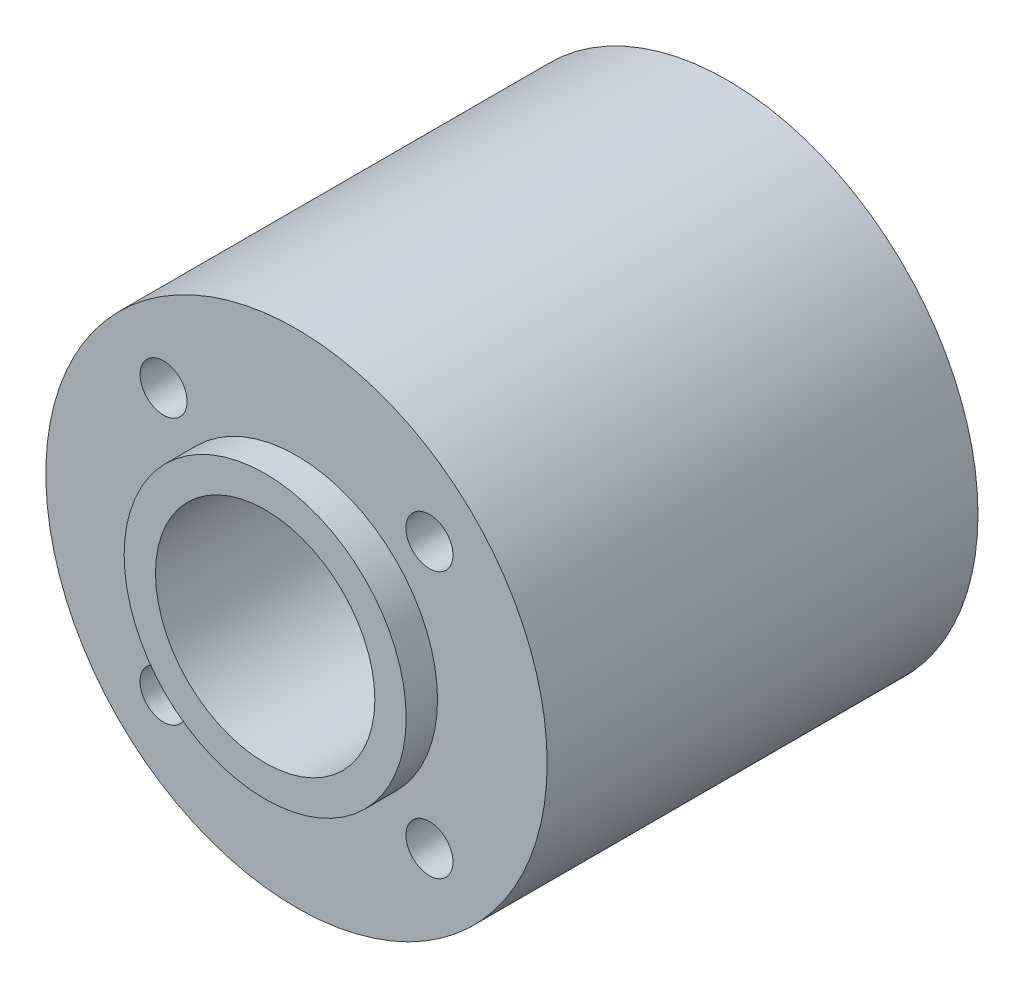
ISO-10303-21;
HEADER;
FILE_DESCRIPTION(('STEP AP214'),'2;1');
FILE_NAME('part.step','',(''),(''),'','','');
FILE_SCHEMA(('AUTOMOTIVE_DESIGN { 1 0 10303 214 1 1 1 1 }'));
ENDSEC;
DATA;
#1=APPLICATION_CONTEXT('core data for automotive mechanical design processes');
#2=APPLICATION_PROTOCOL_DEFINITION('international standard','automotive_design',2000,#1);
#3=PRODUCT_CONTEXT('',#1,'mechanical');
#4=PRODUCT('Part','Part','',(#3));
#5=PRODUCT_RELATED_PRODUCT_CATEGORY('part','',(#4));
#6=PRODUCT_DEFINITION_FORMATION('','',#4);
#7=PRODUCT_DEFINITION_CONTEXT('part definition',#1,'design');
#8=PRODUCT_DEFINITION('design','',#6,#7);
#9=PRODUCT_DEFINITION_SHAPE('','',#8);
#10=(LENGTH_UNIT() NAMED_UNIT(*) SI_UNIT(.MILLI.,.METRE.));
#11=(NAMED_UNIT(*) PLANE_ANGLE_UNIT() SI_UNIT($,.RADIAN.));
#12=(NAMED_UNIT(*) SI_UNIT($,.STERADIAN.) SOLID_ANGLE_UNIT());
#13=UNCERTAINTY_MEASURE_WITH_UNIT(LENGTH_MEASURE(1.E-05),#10,'distance_accuracy_value','');
#14=(GEOMETRIC_REPRESENTATION_CONTEXT(3) GLOBAL_UNCERTAINTY_ASSIGNED_CONTEXT((#13)) GLOBAL_UNIT_ASSIGNED_CONTEXT((#10,
#11,#12)) REPRESENTATION_CONTEXT('',''));
#15=CARTESIAN_POINT('',(0.,0.,0.));
#16=DIRECTION('',(0.,0.,1.));
#17=DIRECTION('',(1.,0.,0.));
#18=AXIS2_PLACEMENT_3D('',#15,#16,#17);
#19=CARTESIAN_POINT('',(0.,0.,27.5));
#20=DIRECTION('',(0.,0.,-1.));
#21=DIRECTION('',(-1.,0.,0.));
#22=AXIS2_PLACEMENT_3D('',#19,#20,#21);
#23=CYLINDRICAL_SURFACE('',#22,16.);
#24=CARTESIAN_POINT('',(0.,0.,27.5));
#25=DIRECTION('',(0.,0.,1.));
#26=DIRECTION('',(1.,0.,0.));
#27=AXIS2_PLACEMENT_3D('',#24,#25,#26);
#28=CIRCLE('',#27,16.);
#29=CARTESIAN_POINT('',(16.,0.,27.5));
#30=VERTEX_POINT('',#29);
#31=EDGE_CURVE('E10',#30,#30,#28,.T.);
#32=ORIENTED_EDGE('',*,*,#31,.F.);
#33=EDGE_LOOP('',(#32));
#34=FACE_BOUND('',#33,.T.);
#35=CARTESIAN_POINT('',(0.,0.,0.));
#36=DIRECTION('',(0.,0.,1.));
#37=DIRECTION('',(1.,0.,0.));
#38=AXIS2_PLACEMENT_3D('',#35,#36,#37);
#39=CIRCLE('',#38,16.);
#40=CARTESIAN_POINT('',(16.,0.,0.));
#41=VERTEX_POINT('',#40);
#42=EDGE_CURVE('E38',#41,#41,#39,.T.);
#43=ORIENTED_EDGE('',*,*,#42,.T.);
#44=EDGE_LOOP('',(#43));
#45=FACE_BOUND('',#44,.T.);
#46=ADVANCED_FACE('F34',(#34,#45),#23,.T.);
#47=CARTESIAN_POINT('',(-8.48528137423859,8.48528137423855,27.5));
#48=DIRECTION('',(0.,0.,-1.));
#49=DIRECTION('',(-1.,0.,0.));
#50=AXIS2_PLACEMENT_3D('',#47,#48,#49);
#51=CYLINDRICAL_SURFACE('',#50,1.5);
#52=CARTESIAN_POINT('',(-8.48528137423859,8.48528137423855,27.5));
#53=DIRECTION('',(0.,0.,1.));
#54=DIRECTION('',(1.,0.,0.));
#55=AXIS2_PLACEMENT_3D('',#52,#53,#54);
#56=CIRCLE('',#55,1.5);
#57=CARTESIAN_POINT('',(-6.98528137423859,8.48528137423855,27.5));
#58=VERTEX_POINT('',#57);
#59=EDGE_CURVE('E42',#58,#58,#56,.T.);
#60=ORIENTED_EDGE('',*,*,#59,.T.);
#61=EDGE_LOOP('',(#60));
#62=FACE_BOUND('',#61,.T.);
#63=CARTESIAN_POINT('',(-8.48528137423859,8.48528137423855,0.));
#64=DIRECTION('',(0.,0.,1.));
#65=DIRECTION('',(1.,0.,0.));
#66=AXIS2_PLACEMENT_3D('',#63,#64,#65);
#67=CIRCLE('',#66,1.5);
#68=CARTESIAN_POINT('',(-6.98528137423859,8.48528137423855,0.));
#69=VERTEX_POINT('',#68);
#70=EDGE_CURVE('E60',#69,#69,#67,.T.);
#71=ORIENTED_EDGE('',*,*,#70,.F.);
#72=EDGE_LOOP('',(#71));
#73=FACE_BOUND('',#72,.T.);
#74=ADVANCED_FACE('F92',(#62,#73),#51,.F.);
#75=CARTESIAN_POINT('',(8.48528137423856,8.48528137423927,27.5));
#76=DIRECTION('',(0.,0.,-1.));
#77=DIRECTION('',(-1.,0.,0.));
#78=AXIS2_PLACEMENT_3D('',#75,#76,#77);
#79=CYLINDRICAL_SURFACE('',#78,1.5);
#80=CARTESIAN_POINT('',(8.48528137423856,8.48528137423927,27.5));
#81=DIRECTION('',(0.,0.,1.));
#82=DIRECTION('',(1.,0.,0.));
#83=AXIS2_PLACEMENT_3D('',#80,#81,#82);
#84=CIRCLE('',#83,1.5);
#85=CARTESIAN_POINT('',(9.98528137423856,8.48528137423927,27.5));
#86=VERTEX_POINT('',#85);
#87=EDGE_CURVE('E47',#86,#86,#84,.T.);
#88=ORIENTED_EDGE('',*,*,#87,.T.);
#89=EDGE_LOOP('',(#88));
#90=FACE_BOUND('',#89,.T.);
#91=CARTESIAN_POINT('',(8.48528137423856,8.48528137423927,0.));
#92=DIRECTION('',(0.,0.,1.));
#93=DIRECTION('',(1.,0.,0.));
#94=AXIS2_PLACEMENT_3D('',#91,#92,#93);
#95=CIRCLE('',#94,1.5);
#96=CARTESIAN_POINT('',(9.98528137423856,8.48528137423927,0.));
#97=VERTEX_POINT('',#96);
#98=EDGE_CURVE('E58',#97,#97,#95,.T.);
#99=ORIENTED_EDGE('',*,*,#98,.F.);
#100=EDGE_LOOP('',(#99));
#101=FACE_BOUND('',#100,.T.);
#102=ADVANCED_FACE('F80',(#90,#101),#79,.F.);
#103=CARTESIAN_POINT('',(8.48528137423928,-8.48528137423787,27.5));
#104=DIRECTION('',(0.,0.,-1.));
#105=DIRECTION('',(-1.,0.,0.));
#106=AXIS2_PLACEMENT_3D('',#103,#104,#105);
#107=CYLINDRICAL_SURFACE('',#106,1.5);
#108=CARTESIAN_POINT('',(8.48528137423928,-8.48528137423787,27.5));
#109=DIRECTION('',(0.,0.,1.));
#110=DIRECTION('',(1.,0.,0.));
#111=AXIS2_PLACEMENT_3D('',#108,#109,#110);
#112=CIRCLE('',#111,1.5);
#113=CARTESIAN_POINT('',(9.98528137423928,-8.48528137423787,27.5));
#114=VERTEX_POINT('',#113);
#115=EDGE_CURVE('E69',#114,#114,#112,.T.);
#116=ORIENTED_EDGE('',*,*,#115,.T.);
#117=EDGE_LOOP('',(#116));
#118=FACE_BOUND('',#117,.T.);
#119=CARTESIAN_POINT('',(8.48528137423928,-8.48528137423787,0.));
#120=DIRECTION('',(0.,0.,1.));
#121=DIRECTION('',(1.,0.,0.));
#122=AXIS2_PLACEMENT_3D('',#119,#120,#121);
#123=CIRCLE('',#122,1.5);
#124=CARTESIAN_POINT('',(9.98528137423928,-8.48528137423787,0.));
#125=VERTEX_POINT('',#124);
#126=EDGE_CURVE('E54',#125,#125,#123,.T.);
#127=ORIENTED_EDGE('',*,*,#126,.F.);
#128=EDGE_LOOP('',(#127));
#129=FACE_BOUND('',#128,.T.);
#130=ADVANCED_FACE('F100',(#118,#129),#107,.F.);
#131=CARTESIAN_POINT('',(-8.48528137423786,-8.48528137423859,27.5));
#132=DIRECTION('',(0.,0.,-1.));
#133=DIRECTION('',(-1.,0.,0.));
#134=AXIS2_PLACEMENT_3D('',#131,#132,#133);
#135=CYLINDRICAL_SURFACE('',#134,1.5);
#136=CARTESIAN_POINT('',(-8.48528137423786,-8.48528137423859,27.5));
#137=DIRECTION('',(0.,0.,1.));
#138=DIRECTION('',(1.,0.,0.));
#139=AXIS2_PLACEMENT_3D('',#136,#137,#138);
#140=CIRCLE('',#139,1.5);
#141=CARTESIAN_POINT('',(-6.98528137423786,-8.48528137423859,27.5));
#142=VERTEX_POINT('',#141);
#143=EDGE_CURVE('E65',#142,#142,#140,.T.);
#144=ORIENTED_EDGE('',*,*,#143,.T.);
#145=EDGE_LOOP('',(#144));
#146=FACE_BOUND('',#145,.T.);
#147=CARTESIAN_POINT('',(-8.48528137423786,-8.48528137423859,0.));
#148=DIRECTION('',(0.,0.,1.));
#149=DIRECTION('',(1.,0.,0.));
#150=AXIS2_PLACEMENT_3D('',#147,#148,#149);
#151=CIRCLE('',#150,1.5);
#152=CARTESIAN_POINT('',(-6.98528137423786,-8.48528137423859,0.));
#153=VERTEX_POINT('',#152);
#154=EDGE_CURVE('E51',#153,#153,#151,.T.);
#155=ORIENTED_EDGE('',*,*,#154,.F.);
#156=EDGE_LOOP('',(#155));
#157=FACE_BOUND('',#156,.T.);
#158=ADVANCED_FACE('F36',(#146,#157),#135,.F.);
#159=CARTESIAN_POINT('',(0.,0.,27.5));
#160=DIRECTION('',(0.,0.,-1.));
#161=DIRECTION('',(-1.,0.,0.));
#162=AXIS2_PLACEMENT_3D('',#159,#160,#161);
#163=CYLINDRICAL_SURFACE('',#162,7.);
#164=CARTESIAN_POINT('',(0.,0.,29.5));
#165=DIRECTION('',(0.,0.,1.));
#166=DIRECTION('',(1.,0.,0.));
#167=AXIS2_PLACEMENT_3D('',#164,#165,#166);
#168=CIRCLE('',#167,7.);
#169=CARTESIAN_POINT('',(7.,0.,29.5));
#170=VERTEX_POINT('',#169);
#171=EDGE_CURVE('E136',#170,#170,#168,.T.);
#172=ORIENTED_EDGE('',*,*,#171,.T.);
#173=EDGE_LOOP('',(#172));
#174=FACE_BOUND('',#173,.T.);
#175=CARTESIAN_POINT('',(0.,0.,-2.));
#176=DIRECTION('',(0.,0.,1.));
#177=DIRECTION('',(1.,0.,0.));
#178=AXIS2_PLACEMENT_3D('',#175,#176,#177);
#179=CIRCLE('',#178,7.);
#180=CARTESIAN_POINT('',(7.,0.,-2.));
#181=VERTEX_POINT('',#180);
#182=EDGE_CURVE('E139',#181,#181,#179,.T.);
#183=ORIENTED_EDGE('',*,*,#182,.F.);
#184=EDGE_LOOP('',(#183));
#185=FACE_BOUND('',#184,.T.);
#186=ADVANCED_FACE('F87',(#174,#185),#163,.F.);
#187=CARTESIAN_POINT('',(0.,0.,27.5));
#188=DIRECTION('',(0.,0.,1.));
#189=DIRECTION('',(1.,0.,0.));
#190=AXIS2_PLACEMENT_3D('',#187,#188,#189);
#191=PLANE('',#190);
#192=CARTESIAN_POINT('',(0.,0.,27.5));
#193=DIRECTION('',(0.,0.,1.));
#194=DIRECTION('',(1.,0.,0.));
#195=AXIS2_PLACEMENT_3D('',#192,#193,#194);
#196=CIRCLE('',#195,9.);
#197=CARTESIAN_POINT('',(9.,0.,27.5));
#198=VERTEX_POINT('',#197);
#199=EDGE_CURVE('E55',#198,#198,#196,.F.);
#200=ORIENTED_EDGE('',*,*,#199,.T.);
#201=EDGE_LOOP('',(#200));
#202=FACE_BOUND('',#201,.T.);
#203=ORIENTED_EDGE('',*,*,#143,.F.);
#204=EDGE_LOOP('',(#203));
#205=FACE_BOUND('',#204,.T.);
#206=ORIENTED_EDGE('',*,*,#115,.F.);
#207=EDGE_LOOP('',(#206));
#208=FACE_BOUND('',#207,.T.);
#209=ORIENTED_EDGE('',*,*,#87,.F.);
#210=EDGE_LOOP('',(#209));
#211=FACE_BOUND('',#210,.T.);
#212=ORIENTED_EDGE('',*,*,#59,.F.);
#213=EDGE_LOOP('',(#212));
#214=FACE_BOUND('',#213,.T.);
#215=ORIENTED_EDGE('',*,*,#31,.T.);
#216=EDGE_LOOP('',(#215));
#217=FACE_BOUND('',#216,.T.);
#218=ADVANCED_FACE('F83',(#202,#205,#208,#211,#214,#217),#191,.T.);
#219=CARTESIAN_POINT('',(0.,0.,0.));
#220=DIRECTION('',(0.,0.,1.));
#221=DIRECTION('',(1.,0.,0.));
#222=AXIS2_PLACEMENT_3D('',#219,#220,#221);
#223=PLANE('',#222);
#224=CARTESIAN_POINT('',(0.,0.,0.));
#225=DIRECTION('',(0.,0.,1.));
#226=DIRECTION('',(1.,0.,0.));
#227=AXIS2_PLACEMENT_3D('',#224,#225,#226);
#228=CIRCLE('',#227,9.);
#229=CARTESIAN_POINT('',(9.,0.,0.));
#230=VERTEX_POINT('',#229);
#231=EDGE_CURVE('E142',#230,#230,#228,.T.);
#232=ORIENTED_EDGE('',*,*,#231,.T.);
#233=EDGE_LOOP('',(#232));
#234=FACE_BOUND('',#233,.T.);
#235=ORIENTED_EDGE('',*,*,#154,.T.);
#236=EDGE_LOOP('',(#235));
#237=FACE_BOUND('',#236,.T.);
#238=ORIENTED_EDGE('',*,*,#126,.T.);
#239=EDGE_LOOP('',(#238));
#240=FACE_BOUND('',#239,.T.);
#241=ORIENTED_EDGE('',*,*,#98,.T.);
#242=EDGE_LOOP('',(#241));
#243=FACE_BOUND('',#242,.T.);
#244=ORIENTED_EDGE('',*,*,#70,.T.);
#245=EDGE_LOOP('',(#244));
#246=FACE_BOUND('',#245,.T.);
#247=ORIENTED_EDGE('',*,*,#42,.F.);
#248=EDGE_LOOP('',(#247));
#249=FACE_BOUND('',#248,.T.);
#250=ADVANCED_FACE('F86',(#234,#237,#240,#243,#246,#249),#223,.F.);
#251=CARTESIAN_POINT('',(0.,0.,29.5));
#252=DIRECTION('',(0.,0.,-1.));
#253=DIRECTION('',(-1.,0.,0.));
#254=AXIS2_PLACEMENT_3D('',#251,#252,#253);
#255=CYLINDRICAL_SURFACE('',#254,9.);
#256=ORIENTED_EDGE('',*,*,#199,.F.);
#257=EDGE_LOOP('',(#256));
#258=FACE_BOUND('',#257,.T.);
#259=CARTESIAN_POINT('',(0.,0.,29.5));
#260=DIRECTION('',(0.,0.,1.));
#261=DIRECTION('',(1.,0.,0.));
#262=AXIS2_PLACEMENT_3D('',#259,#260,#261);
#263=CIRCLE('',#262,9.);
#264=CARTESIAN_POINT('',(9.,0.,29.5));
#265=VERTEX_POINT('',#264);
#266=EDGE_CURVE('E148',#265,#265,#263,.T.);
#267=ORIENTED_EDGE('',*,*,#266,.F.);
#268=EDGE_LOOP('',(#267));
#269=FACE_BOUND('',#268,.T.);
#270=ADVANCED_FACE('F116',(#258,#269),#255,.T.);
#271=CARTESIAN_POINT('',(0.,0.,29.5));
#272=DIRECTION('',(0.,0.,1.));
#273=DIRECTION('',(1.,0.,0.));
#274=AXIS2_PLACEMENT_3D('',#271,#272,#273);
#275=PLANE('',#274);
#276=ORIENTED_EDGE('',*,*,#171,.F.);
#277=EDGE_LOOP('',(#276));
#278=FACE_BOUND('',#277,.T.);
#279=ORIENTED_EDGE('',*,*,#266,.T.);
#280=EDGE_LOOP('',(#279));
#281=FACE_BOUND('',#280,.T.);
#282=ADVANCED_FACE('F124',(#278,#281),#275,.T.);
#283=CARTESIAN_POINT('',(0.,0.,-2.));
#284=DIRECTION('',(0.,0.,1.));
#285=DIRECTION('',(1.,0.,0.));
#286=AXIS2_PLACEMENT_3D('',#283,#284,#285);
#287=CYLINDRICAL_SURFACE('',#286,9.);
#288=CARTESIAN_POINT('',(0.,0.,-2.));
#289=DIRECTION('',(0.,0.,1.));
#290=DIRECTION('',(1.,0.,0.));
#291=AXIS2_PLACEMENT_3D('',#288,#289,#290);
#292=CIRCLE('',#291,9.);
#293=CARTESIAN_POINT('',(9.,0.,-2.));
#294=VERTEX_POINT('',#293);
#295=EDGE_CURVE('E141',#294,#294,#292,.T.);
#296=ORIENTED_EDGE('',*,*,#295,.T.);
#297=EDGE_LOOP('',(#296));
#298=FACE_BOUND('',#297,.T.);
#299=ORIENTED_EDGE('',*,*,#231,.F.);
#300=EDGE_LOOP('',(#299));
#301=FACE_BOUND('',#300,.T.);
#302=ADVANCED_FACE('F158',(#298,#301),#287,.T.);
#303=CARTESIAN_POINT('',(0.,0.,-2.));
#304=DIRECTION('',(0.,0.,1.));
#305=DIRECTION('',(1.,0.,0.));
#306=AXIS2_PLACEMENT_3D('',#303,#304,#305);
#307=PLANE('',#306);
#308=ORIENTED_EDGE('',*,*,#182,.T.);
#309=EDGE_LOOP('',(#308));
#310=FACE_BOUND('',#309,.T.);
#311=ORIENTED_EDGE('',*,*,#295,.F.);
#312=EDGE_LOOP('',(#311));
#313=FACE_BOUND('',#312,.T.);
#314=ADVANCED_FACE('F164',(#310,#313),#307,.F.);
#315=CLOSED_SHELL('',(#46,#74,#102,#130,#158,#186,#218,#250,#270,#282,#302,#314));
#316=MANIFOLD_SOLID_BREP('B2',#315);
#317=ADVANCED_BREP_SHAPE_REPRESENTATION('',(#18,#316),#14);
#318=SHAPE_DEFINITION_REPRESENTATION(#9,#317);
ENDSEC;
END-ISO-10303-21;
